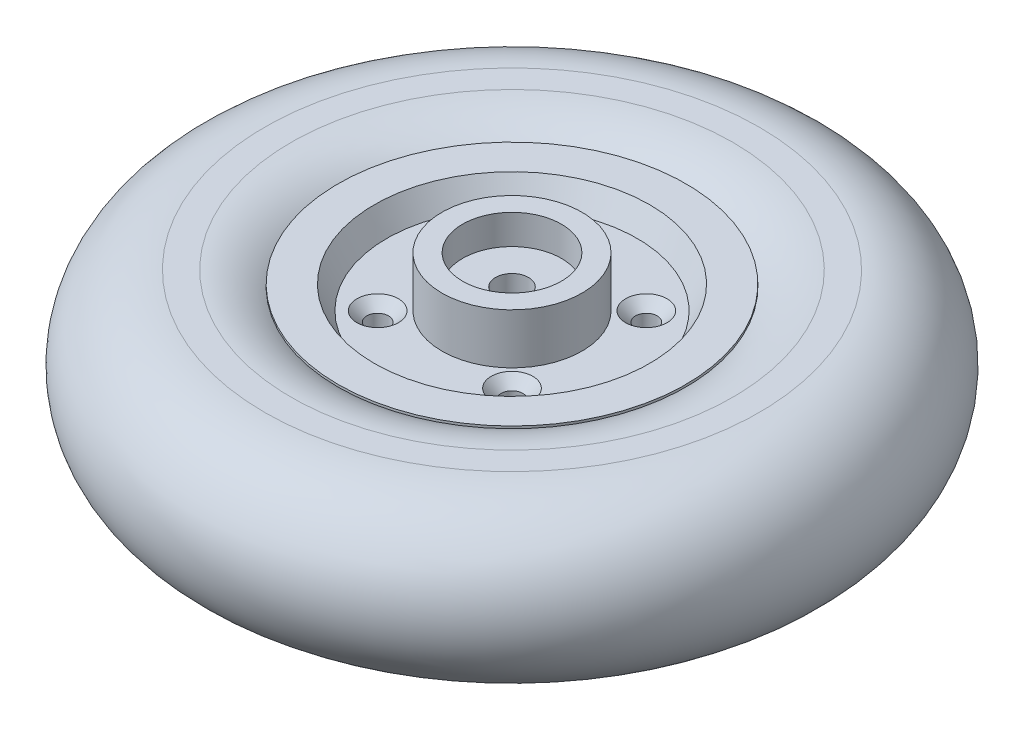
ISO-10303-21;
HEADER;
FILE_DESCRIPTION(('STEP AP214'),'2;1');
FILE_NAME('part.step','',(''),(''),'','','');
FILE_SCHEMA(('AUTOMOTIVE_DESIGN { 1 0 10303 214 1 1 1 1 }'));
ENDSEC;
DATA;
#1=APPLICATION_CONTEXT('core data for automotive mechanical design processes');
#2=APPLICATION_PROTOCOL_DEFINITION('international standard','automotive_design',2000,#1);
#3=PRODUCT_CONTEXT('',#1,'mechanical');
#4=PRODUCT('Part','Part','',(#3));
#5=PRODUCT_RELATED_PRODUCT_CATEGORY('part','',(#4));
#6=PRODUCT_DEFINITION_FORMATION('','',#4);
#7=PRODUCT_DEFINITION_CONTEXT('part definition',#1,'design');
#8=PRODUCT_DEFINITION('design','',#6,#7);
#9=PRODUCT_DEFINITION_SHAPE('','',#8);
#10=(LENGTH_UNIT() NAMED_UNIT(*) SI_UNIT(.MILLI.,.METRE.));
#11=(NAMED_UNIT(*) PLANE_ANGLE_UNIT() SI_UNIT($,.RADIAN.));
#12=(NAMED_UNIT(*) SI_UNIT($,.STERADIAN.) SOLID_ANGLE_UNIT());
#13=UNCERTAINTY_MEASURE_WITH_UNIT(LENGTH_MEASURE(1.E-05),#10,'distance_accuracy_value','');
#14=(GEOMETRIC_REPRESENTATION_CONTEXT(3) GLOBAL_UNCERTAINTY_ASSIGNED_CONTEXT((#13)) GLOBAL_UNIT_ASSIGNED_CONTEXT((#10,
#11,#12)) REPRESENTATION_CONTEXT('',''));
#15=CARTESIAN_POINT('',(0.,0.,0.));
#16=DIRECTION('',(0.,0.,1.));
#17=DIRECTION('',(1.,0.,0.));
#18=AXIS2_PLACEMENT_3D('',#15,#16,#17);
#19=CARTESIAN_POINT('',(0.,152.231132075472,0.));
#20=DIRECTION('',(0.,1.,0.));
#21=DIRECTION('',(0.,0.,1.));
#22=AXIS2_PLACEMENT_3D('',#19,#20,#21);
#23=CYLINDRICAL_SURFACE('',#22,52.75);
#24=CARTESIAN_POINT('',(0.,-21.25,0.));
#25=DIRECTION('',(0.,1.,0.));
#26=DIRECTION('',(0.,0.,1.));
#27=AXIS2_PLACEMENT_3D('',#24,#25,#26);
#28=CIRCLE('',#27,52.75);
#29=CARTESIAN_POINT('',(0.,-21.25,52.75));
#30=VERTEX_POINT('',#29);
#31=EDGE_CURVE('E108',#30,#30,#28,.T.);
#32=ORIENTED_EDGE('',*,*,#31,.T.);
#33=EDGE_LOOP('',(#32));
#34=FACE_BOUND('',#33,.T.);
#35=CARTESIAN_POINT('',(0.,-20.5411173016465,0.));
#36=DIRECTION('',(0.,1.,0.));
#37=DIRECTION('',(0.,0.,1.));
#38=AXIS2_PLACEMENT_3D('',#35,#36,#37);
#39=CIRCLE('',#38,52.75);
#40=CARTESIAN_POINT('',(0.,-20.5411173016465,52.75));
#41=VERTEX_POINT('',#40);
#42=EDGE_CURVE('E10',#41,#41,#39,.T.);
#43=ORIENTED_EDGE('',*,*,#42,.F.);
#44=EDGE_LOOP('',(#43));
#45=FACE_BOUND('',#44,.T.);
#46=ADVANCED_FACE('F30',(#34,#45),#23,.T.);
#47=CARTESIAN_POINT('',(0.,21.25,0.));
#48=DIRECTION('',(0.,1.,0.));
#49=DIRECTION('',(0.,0.,1.));
#50=AXIS2_PLACEMENT_3D('',#47,#48,#49);
#51=CIRCLE('',#50,52.75);
#52=CARTESIAN_POINT('',(0.,21.25,52.75));
#53=VERTEX_POINT('',#52);
#54=EDGE_CURVE('E111',#53,#53,#51,.T.);
#55=ORIENTED_EDGE('',*,*,#54,.F.);
#56=EDGE_LOOP('',(#55));
#57=FACE_BOUND('',#56,.T.);
#58=CARTESIAN_POINT('',(0.,20.5411173016465,0.));
#59=DIRECTION('',(0.,-1.,0.));
#60=DIRECTION('',(0.,0.,-1.));
#61=AXIS2_PLACEMENT_3D('',#58,#59,#60);
#62=CIRCLE('',#61,52.75);
#63=CARTESIAN_POINT('',(0.,20.5411173016465,-52.75));
#64=VERTEX_POINT('',#63);
#65=EDGE_CURVE('E38',#64,#64,#62,.T.);
#66=ORIENTED_EDGE('',*,*,#65,.F.);
#67=EDGE_LOOP('',(#66));
#68=FACE_BOUND('',#67,.T.);
#69=ADVANCED_FACE('F187',(#57,#68),#23,.T.);
#70=CARTESIAN_POINT('',(5.00000000000002,-20.5,0.));
#71=DIRECTION('',(0.,1.,0.));
#72=DIRECTION('',(0.,0.,1.));
#73=AXIS2_PLACEMENT_3D('',#70,#71,#72);
#74=PLANE('',#73);
#75=CARTESIAN_POINT('',(0.,-20.5,0.));
#76=DIRECTION('',(0.,1.,0.));
#77=DIRECTION('',(0.,0.,1.));
#78=AXIS2_PLACEMENT_3D('',#75,#76,#77);
#79=CIRCLE('',#78,15.);
#80=CARTESIAN_POINT('',(0.,-20.5,15.));
#81=VERTEX_POINT('',#80);
#82=EDGE_CURVE('E90',#81,#81,#79,.T.);
#83=ORIENTED_EDGE('',*,*,#82,.F.);
#84=EDGE_LOOP('',(#83));
#85=FACE_BOUND('',#84,.T.);
#86=CARTESIAN_POINT('',(0.,-20.5,0.));
#87=DIRECTION('',(0.,1.,0.));
#88=DIRECTION('',(0.,0.,1.));
#89=AXIS2_PLACEMENT_3D('',#86,#87,#88);
#90=CIRCLE('',#89,5.00000000000002);
#91=CARTESIAN_POINT('',(0.,-20.5,5.00000000000002));
#92=VERTEX_POINT('',#91);
#93=EDGE_CURVE('E43',#92,#92,#90,.T.);
#94=ORIENTED_EDGE('',*,*,#93,.T.);
#95=EDGE_LOOP('',(#94));
#96=FACE_BOUND('',#95,.T.);
#97=ADVANCED_FACE('F32',(#85,#96),#74,.F.);
#98=CARTESIAN_POINT('',(0.,152.231132075472,0.));
#99=DIRECTION('',(0.,1.,0.));
#100=DIRECTION('',(0.,0.,1.));
#101=AXIS2_PLACEMENT_3D('',#98,#99,#100);
#102=CYLINDRICAL_SURFACE('',#101,5.00000000000002);
#103=ORIENTED_EDGE('',*,*,#93,.F.);
#104=EDGE_LOOP('',(#103));
#105=FACE_BOUND('',#104,.T.);
#106=CARTESIAN_POINT('',(0.,20.5,0.));
#107=DIRECTION('',(0.,1.,0.));
#108=DIRECTION('',(0.,0.,1.));
#109=AXIS2_PLACEMENT_3D('',#106,#107,#108);
#110=CIRCLE('',#109,5.00000000000002);
#111=CARTESIAN_POINT('',(0.,20.5,5.00000000000002));
#112=VERTEX_POINT('',#111);
#113=EDGE_CURVE('E132',#112,#112,#110,.T.);
#114=ORIENTED_EDGE('',*,*,#113,.T.);
#115=EDGE_LOOP('',(#114));
#116=FACE_BOUND('',#115,.T.);
#117=ADVANCED_FACE('F138',(#105,#116),#102,.F.);
#118=CARTESIAN_POINT('',(5.00000000000002,20.5,0.));
#119=DIRECTION('',(0.,-1.,0.));
#120=DIRECTION('',(0.,0.,-1.));
#121=AXIS2_PLACEMENT_3D('',#118,#119,#120);
#122=PLANE('',#121);
#123=ORIENTED_EDGE('',*,*,#113,.F.);
#124=EDGE_LOOP('',(#123));
#125=FACE_BOUND('',#124,.T.);
#126=CARTESIAN_POINT('',(0.,20.5,0.));
#127=DIRECTION('',(0.,1.,0.));
#128=DIRECTION('',(0.,0.,1.));
#129=AXIS2_PLACEMENT_3D('',#126,#127,#128);
#130=CIRCLE('',#129,15.);
#131=CARTESIAN_POINT('',(0.,20.5,15.));
#132=VERTEX_POINT('',#131);
#133=EDGE_CURVE('E129',#132,#132,#130,.T.);
#134=ORIENTED_EDGE('',*,*,#133,.T.);
#135=EDGE_LOOP('',(#134));
#136=FACE_BOUND('',#135,.T.);
#137=ADVANCED_FACE('F141',(#125,#136),#122,.F.);
#138=CARTESIAN_POINT('',(0.,152.231132075472,0.));
#139=DIRECTION('',(0.,1.,0.));
#140=DIRECTION('',(0.,0.,1.));
#141=AXIS2_PLACEMENT_3D('',#138,#139,#140);
#142=CYLINDRICAL_SURFACE('',#141,15.);
#143=ORIENTED_EDGE('',*,*,#133,.F.);
#144=EDGE_LOOP('',(#143));
#145=FACE_BOUND('',#144,.T.);
#146=CARTESIAN_POINT('',(0.,29.5,0.));
#147=DIRECTION('',(0.,1.,0.));
#148=DIRECTION('',(0.,0.,1.));
#149=AXIS2_PLACEMENT_3D('',#146,#147,#148);
#150=CIRCLE('',#149,15.);
#151=CARTESIAN_POINT('',(0.,29.5,15.));
#152=VERTEX_POINT('',#151);
#153=EDGE_CURVE('E126',#152,#152,#150,.T.);
#154=ORIENTED_EDGE('',*,*,#153,.T.);
#155=EDGE_LOOP('',(#154));
#156=FACE_BOUND('',#155,.T.);
#157=ADVANCED_FACE('F146',(#145,#156),#142,.F.);
#158=CARTESIAN_POINT('',(15.,29.5,0.));
#159=DIRECTION('',(0.,-1.,0.));
#160=DIRECTION('',(0.,0.,-1.));
#161=AXIS2_PLACEMENT_3D('',#158,#159,#160);
#162=PLANE('',#161);
#163=ORIENTED_EDGE('',*,*,#153,.F.);
#164=EDGE_LOOP('',(#163));
#165=FACE_BOUND('',#164,.T.);
#166=CARTESIAN_POINT('',(0.,29.5,0.));
#167=DIRECTION('',(0.,1.,0.));
#168=DIRECTION('',(0.,0.,1.));
#169=AXIS2_PLACEMENT_3D('',#166,#167,#168);
#170=CIRCLE('',#169,21.25);
#171=CARTESIAN_POINT('',(0.,29.5,21.25));
#172=VERTEX_POINT('',#171);
#173=EDGE_CURVE('E123',#172,#172,#170,.T.);
#174=ORIENTED_EDGE('',*,*,#173,.T.);
#175=EDGE_LOOP('',(#174));
#176=FACE_BOUND('',#175,.T.);
#177=ADVANCED_FACE('F152',(#165,#176),#162,.F.);
#178=CARTESIAN_POINT('',(0.,152.231132075472,0.));
#179=DIRECTION('',(0.,1.,0.));
#180=DIRECTION('',(0.,0.,1.));
#181=AXIS2_PLACEMENT_3D('',#178,#179,#180);
#182=CYLINDRICAL_SURFACE('',#181,21.25);
#183=ORIENTED_EDGE('',*,*,#173,.F.);
#184=EDGE_LOOP('',(#183));
#185=FACE_BOUND('',#184,.T.);
#186=CARTESIAN_POINT('',(0.,14.25,0.));
#187=DIRECTION('',(0.,1.,0.));
#188=DIRECTION('',(0.,0.,1.));
#189=AXIS2_PLACEMENT_3D('',#186,#187,#188);
#190=CIRCLE('',#189,21.25);
#191=CARTESIAN_POINT('',(0.,14.25,21.25));
#192=VERTEX_POINT('',#191);
#193=EDGE_CURVE('E120',#192,#192,#190,.T.);
#194=ORIENTED_EDGE('',*,*,#193,.T.);
#195=EDGE_LOOP('',(#194));
#196=FACE_BOUND('',#195,.T.);
#197=ADVANCED_FACE('F158',(#185,#196),#182,.T.);
#198=CARTESIAN_POINT('',(38.,14.25,0.));
#199=DIRECTION('',(0.,-1.,0.));
#200=DIRECTION('',(0.,0.,-1.));
#201=AXIS2_PLACEMENT_3D('',#198,#199,#200);
#202=PLANE('',#201);
#203=CARTESIAN_POINT('',(-20.375,14.25,20.375));
#204=DIRECTION('',(0.,1.,0.));
#205=DIRECTION('',(0.,0.,1.));
#206=AXIS2_PLACEMENT_3D('',#203,#204,#205);
#207=CIRCLE('',#206,6.3);
#208=CARTESIAN_POINT('',(-20.375,14.25,26.675));
#209=VERTEX_POINT('',#208);
#210=EDGE_CURVE('E292',#209,#209,#207,.T.);
#211=ORIENTED_EDGE('',*,*,#210,.F.);
#212=EDGE_LOOP('',(#211));
#213=FACE_BOUND('',#212,.T.);
#214=CARTESIAN_POINT('',(-20.375,14.25,-20.375));
#215=DIRECTION('',(0.,1.,0.));
#216=DIRECTION('',(0.,0.,1.));
#217=AXIS2_PLACEMENT_3D('',#214,#215,#216);
#218=CIRCLE('',#217,6.3);
#219=CARTESIAN_POINT('',(-20.375,14.25,-14.075));
#220=VERTEX_POINT('',#219);
#221=EDGE_CURVE('E65',#220,#220,#218,.T.);
#222=ORIENTED_EDGE('',*,*,#221,.F.);
#223=EDGE_LOOP('',(#222));
#224=FACE_BOUND('',#223,.T.);
#225=CARTESIAN_POINT('',(20.375,14.25,20.375));
#226=DIRECTION('',(0.,1.,0.));
#227=DIRECTION('',(0.,0.,1.));
#228=AXIS2_PLACEMENT_3D('',#225,#226,#227);
#229=CIRCLE('',#228,6.3);
#230=CARTESIAN_POINT('',(20.375,14.25,26.675));
#231=VERTEX_POINT('',#230);
#232=EDGE_CURVE('E58',#231,#231,#229,.T.);
#233=ORIENTED_EDGE('',*,*,#232,.F.);
#234=EDGE_LOOP('',(#233));
#235=FACE_BOUND('',#234,.T.);
#236=CARTESIAN_POINT('',(20.375,14.25,-20.375));
#237=DIRECTION('',(0.,1.,0.));
#238=DIRECTION('',(0.,0.,1.));
#239=AXIS2_PLACEMENT_3D('',#236,#237,#238);
#240=CIRCLE('',#239,6.3);
#241=CARTESIAN_POINT('',(20.375,14.25,-14.075));
#242=VERTEX_POINT('',#241);
#243=EDGE_CURVE('E54',#242,#242,#240,.T.);
#244=ORIENTED_EDGE('',*,*,#243,.F.);
#245=EDGE_LOOP('',(#244));
#246=FACE_BOUND('',#245,.T.);
#247=ORIENTED_EDGE('',*,*,#193,.F.);
#248=EDGE_LOOP('',(#247));
#249=FACE_BOUND('',#248,.T.);
#250=CARTESIAN_POINT('',(0.,14.25,0.));
#251=DIRECTION('',(0.,1.,0.));
#252=DIRECTION('',(0.,0.,1.));
#253=AXIS2_PLACEMENT_3D('',#250,#251,#252);
#254=CIRCLE('',#253,38.);
#255=CARTESIAN_POINT('',(0.,14.25,38.));
#256=VERTEX_POINT('',#255);
#257=EDGE_CURVE('E117',#256,#256,#254,.T.);
#258=ORIENTED_EDGE('',*,*,#257,.T.);
#259=EDGE_LOOP('',(#258));
#260=FACE_BOUND('',#259,.T.);
#261=ADVANCED_FACE('F164',(#213,#224,#235,#246,#249,#260),#202,.F.);
#262=CARTESIAN_POINT('',(0.,21.25,0.));
#263=DIRECTION('',(0.,1.,0.));
#264=DIRECTION('',(0.,0.,1.));
#265=AXIS2_PLACEMENT_3D('',#262,#263,#264);
#266=CONICAL_SURFACE('',#265,41.75,0.491809175988701);
#267=ORIENTED_EDGE('',*,*,#257,.F.);
#268=EDGE_LOOP('',(#267));
#269=FACE_BOUND('',#268,.T.);
#270=CARTESIAN_POINT('',(0.,21.25,0.));
#271=DIRECTION('',(0.,1.,0.));
#272=DIRECTION('',(0.,0.,1.));
#273=AXIS2_PLACEMENT_3D('',#270,#271,#272);
#274=CIRCLE('',#273,41.75);
#275=CARTESIAN_POINT('',(0.,21.25,41.75));
#276=VERTEX_POINT('',#275);
#277=EDGE_CURVE('E114',#276,#276,#274,.T.);
#278=ORIENTED_EDGE('',*,*,#277,.T.);
#279=EDGE_LOOP('',(#278));
#280=FACE_BOUND('',#279,.T.);
#281=ADVANCED_FACE('F170',(#269,#280),#266,.F.);
#282=CARTESIAN_POINT('',(41.75,21.25,0.));
#283=DIRECTION('',(0.,-1.,0.));
#284=DIRECTION('',(0.,0.,-1.));
#285=AXIS2_PLACEMENT_3D('',#282,#283,#284);
#286=PLANE('',#285);
#287=ORIENTED_EDGE('',*,*,#277,.F.);
#288=EDGE_LOOP('',(#287));
#289=FACE_BOUND('',#288,.T.);
#290=ORIENTED_EDGE('',*,*,#54,.T.);
#291=EDGE_LOOP('',(#290));
#292=FACE_BOUND('',#291,.T.);
#293=ADVANCED_FACE('F177',(#289,#292),#286,.F.);
#294=CARTESIAN_POINT('',(41.75,-21.25,0.));
#295=DIRECTION('',(0.,1.,0.));
#296=DIRECTION('',(0.,0.,1.));
#297=AXIS2_PLACEMENT_3D('',#294,#295,#296);
#298=PLANE('',#297);
#299=ORIENTED_EDGE('',*,*,#31,.F.);
#300=EDGE_LOOP('',(#299));
#301=FACE_BOUND('',#300,.T.);
#302=CARTESIAN_POINT('',(0.,-21.25,0.));
#303=DIRECTION('',(0.,1.,0.));
#304=DIRECTION('',(0.,0.,1.));
#305=AXIS2_PLACEMENT_3D('',#302,#303,#304);
#306=CIRCLE('',#305,41.75);
#307=CARTESIAN_POINT('',(0.,-21.25,41.75));
#308=VERTEX_POINT('',#307);
#309=EDGE_CURVE('E105',#308,#308,#306,.T.);
#310=ORIENTED_EDGE('',*,*,#309,.T.);
#311=EDGE_LOOP('',(#310));
#312=FACE_BOUND('',#311,.T.);
#313=ADVANCED_FACE('F183',(#301,#312),#298,.F.);
#314=CARTESIAN_POINT('',(0.,-14.25,0.));
#315=DIRECTION('',(0.,-1.,0.));
#316=DIRECTION('',(0.,0.,-1.));
#317=AXIS2_PLACEMENT_3D('',#314,#315,#316);
#318=CONICAL_SURFACE('',#317,38.,0.491809175988701);
#319=ORIENTED_EDGE('',*,*,#309,.F.);
#320=EDGE_LOOP('',(#319));
#321=FACE_BOUND('',#320,.T.);
#322=CARTESIAN_POINT('',(0.,-14.25,0.));
#323=DIRECTION('',(0.,1.,0.));
#324=DIRECTION('',(0.,0.,1.));
#325=AXIS2_PLACEMENT_3D('',#322,#323,#324);
#326=CIRCLE('',#325,38.);
#327=CARTESIAN_POINT('',(0.,-14.25,38.));
#328=VERTEX_POINT('',#327);
#329=EDGE_CURVE('E102',#328,#328,#326,.T.);
#330=ORIENTED_EDGE('',*,*,#329,.T.);
#331=EDGE_LOOP('',(#330));
#332=FACE_BOUND('',#331,.T.);
#333=ADVANCED_FACE('F219',(#321,#332),#318,.F.);
#334=CARTESIAN_POINT('',(38.,-14.25,0.));
#335=DIRECTION('',(0.,1.,0.));
#336=DIRECTION('',(0.,0.,1.));
#337=AXIS2_PLACEMENT_3D('',#334,#335,#336);
#338=PLANE('',#337);
#339=CARTESIAN_POINT('',(-20.375,-14.25,20.375));
#340=DIRECTION('',(0.,1.,0.));
#341=DIRECTION('',(0.,0.,1.));
#342=AXIS2_PLACEMENT_3D('',#339,#340,#341);
#343=CIRCLE('',#342,3.3);
#344=CARTESIAN_POINT('',(-20.375,-14.25,23.675));
#345=VERTEX_POINT('',#344);
#346=EDGE_CURVE('E34',#345,#345,#343,.T.);
#347=ORIENTED_EDGE('',*,*,#346,.T.);
#348=EDGE_LOOP('',(#347));
#349=FACE_BOUND('',#348,.T.);
#350=CARTESIAN_POINT('',(-20.375,-14.25,-20.375));
#351=DIRECTION('',(0.,1.,0.));
#352=DIRECTION('',(0.,0.,1.));
#353=AXIS2_PLACEMENT_3D('',#350,#351,#352);
#354=CIRCLE('',#353,3.3);
#355=CARTESIAN_POINT('',(-20.375,-14.25,-17.075));
#356=VERTEX_POINT('',#355);
#357=EDGE_CURVE('E56',#356,#356,#354,.T.);
#358=ORIENTED_EDGE('',*,*,#357,.T.);
#359=EDGE_LOOP('',(#358));
#360=FACE_BOUND('',#359,.T.);
#361=CARTESIAN_POINT('',(20.375,-14.25,20.375));
#362=DIRECTION('',(0.,1.,0.));
#363=DIRECTION('',(0.,0.,1.));
#364=AXIS2_PLACEMENT_3D('',#361,#362,#363);
#365=CIRCLE('',#364,3.3);
#366=CARTESIAN_POINT('',(20.375,-14.25,23.675));
#367=VERTEX_POINT('',#366);
#368=EDGE_CURVE('E52',#367,#367,#365,.T.);
#369=ORIENTED_EDGE('',*,*,#368,.T.);
#370=EDGE_LOOP('',(#369));
#371=FACE_BOUND('',#370,.T.);
#372=CARTESIAN_POINT('',(20.375,-14.25,-20.375));
#373=DIRECTION('',(0.,1.,0.));
#374=DIRECTION('',(0.,0.,1.));
#375=AXIS2_PLACEMENT_3D('',#372,#373,#374);
#376=CIRCLE('',#375,3.3);
#377=CARTESIAN_POINT('',(20.375,-14.25,-17.075));
#378=VERTEX_POINT('',#377);
#379=EDGE_CURVE('E47',#378,#378,#376,.T.);
#380=ORIENTED_EDGE('',*,*,#379,.T.);
#381=EDGE_LOOP('',(#380));
#382=FACE_BOUND('',#381,.T.);
#383=ORIENTED_EDGE('',*,*,#329,.F.);
#384=EDGE_LOOP('',(#383));
#385=FACE_BOUND('',#384,.T.);
#386=CARTESIAN_POINT('',(0.,-14.25,0.));
#387=DIRECTION('',(0.,1.,0.));
#388=DIRECTION('',(0.,0.,1.));
#389=AXIS2_PLACEMENT_3D('',#386,#387,#388);
#390=CIRCLE('',#389,21.25);
#391=CARTESIAN_POINT('',(0.,-14.25,21.25));
#392=VERTEX_POINT('',#391);
#393=EDGE_CURVE('E99',#392,#392,#390,.T.);
#394=ORIENTED_EDGE('',*,*,#393,.T.);
#395=EDGE_LOOP('',(#394));
#396=FACE_BOUND('',#395,.T.);
#397=ADVANCED_FACE('F223',(#349,#360,#371,#382,#385,#396),#338,.F.);
#398=CARTESIAN_POINT('',(0.,152.231132075472,0.));
#399=DIRECTION('',(0.,1.,0.));
#400=DIRECTION('',(0.,0.,1.));
#401=AXIS2_PLACEMENT_3D('',#398,#399,#400);
#402=CYLINDRICAL_SURFACE('',#401,21.25);
#403=ORIENTED_EDGE('',*,*,#393,.F.);
#404=EDGE_LOOP('',(#403));
#405=FACE_BOUND('',#404,.T.);
#406=CARTESIAN_POINT('',(0.,-29.5,0.));
#407=DIRECTION('',(0.,1.,0.));
#408=DIRECTION('',(0.,0.,1.));
#409=AXIS2_PLACEMENT_3D('',#406,#407,#408);
#410=CIRCLE('',#409,21.25);
#411=CARTESIAN_POINT('',(0.,-29.5,21.25));
#412=VERTEX_POINT('',#411);
#413=EDGE_CURVE('E96',#412,#412,#410,.T.);
#414=ORIENTED_EDGE('',*,*,#413,.T.);
#415=EDGE_LOOP('',(#414));
#416=FACE_BOUND('',#415,.T.);
#417=ADVANCED_FACE('F227',(#405,#416),#402,.T.);
#418=CARTESIAN_POINT('',(15.,-29.5,0.));
#419=DIRECTION('',(0.,1.,0.));
#420=DIRECTION('',(0.,0.,1.));
#421=AXIS2_PLACEMENT_3D('',#418,#419,#420);
#422=PLANE('',#421);
#423=ORIENTED_EDGE('',*,*,#413,.F.);
#424=EDGE_LOOP('',(#423));
#425=FACE_BOUND('',#424,.T.);
#426=CARTESIAN_POINT('',(0.,-29.5,0.));
#427=DIRECTION('',(0.,1.,0.));
#428=DIRECTION('',(0.,0.,1.));
#429=AXIS2_PLACEMENT_3D('',#426,#427,#428);
#430=CIRCLE('',#429,15.);
#431=CARTESIAN_POINT('',(0.,-29.5,15.));
#432=VERTEX_POINT('',#431);
#433=EDGE_CURVE('E93',#432,#432,#430,.T.);
#434=ORIENTED_EDGE('',*,*,#433,.T.);
#435=EDGE_LOOP('',(#434));
#436=FACE_BOUND('',#435,.T.);
#437=ADVANCED_FACE('F231',(#425,#436),#422,.F.);
#438=CARTESIAN_POINT('',(0.,152.231132075472,0.));
#439=DIRECTION('',(0.,1.,0.));
#440=DIRECTION('',(0.,0.,1.));
#441=AXIS2_PLACEMENT_3D('',#438,#439,#440);
#442=CYLINDRICAL_SURFACE('',#441,15.);
#443=ORIENTED_EDGE('',*,*,#433,.F.);
#444=EDGE_LOOP('',(#443));
#445=FACE_BOUND('',#444,.T.);
#446=ORIENTED_EDGE('',*,*,#82,.T.);
#447=EDGE_LOOP('',(#446));
#448=FACE_BOUND('',#447,.T.);
#449=ADVANCED_FACE('F206',(#445,#448),#442,.F.);
#450=CARTESIAN_POINT('',(0.,0.,0.));
#451=DIRECTION('',(0.,-1.,0.));
#452=DIRECTION('',(0.,0.,-1.));
#453=AXIS2_PLACEMENT_3D('',#450,#451,#452);
#454=TOROIDAL_SURFACE('',#453,67.,25.);
#455=CARTESIAN_POINT('',(0.,-25.,0.));
#456=DIRECTION('',(0.,-1.,0.));
#457=DIRECTION('',(0.,0.,-1.));
#458=AXIS2_PLACEMENT_3D('',#455,#456,#457);
#459=CIRCLE('',#458,67.);
#460=CARTESIAN_POINT('',(0.,-25.,-67.));
#461=VERTEX_POINT('',#460);
#462=EDGE_CURVE('E84',#461,#461,#459,.T.);
#463=ORIENTED_EDGE('',*,*,#462,.T.);
#464=EDGE_LOOP('',(#463));
#465=FACE_BOUND('',#464,.T.);
#466=ORIENTED_EDGE('',*,*,#42,.T.);
#467=EDGE_LOOP('',(#466));
#468=FACE_BOUND('',#467,.T.);
#469=ADVANCED_FACE('F196',(#465,#468),#454,.T.);
#470=CARTESIAN_POINT('',(0.,25.,0.));
#471=DIRECTION('',(0.,-1.,0.));
#472=DIRECTION('',(0.,0.,-1.));
#473=AXIS2_PLACEMENT_3D('',#470,#471,#472);
#474=CIRCLE('',#473,67.);
#475=CARTESIAN_POINT('',(0.,25.,-67.));
#476=VERTEX_POINT('',#475);
#477=EDGE_CURVE('E81',#476,#476,#474,.T.);
#478=ORIENTED_EDGE('',*,*,#477,.F.);
#479=EDGE_LOOP('',(#478));
#480=FACE_BOUND('',#479,.T.);
#481=ORIENTED_EDGE('',*,*,#65,.T.);
#482=EDGE_LOOP('',(#481));
#483=FACE_BOUND('',#482,.T.);
#484=ADVANCED_FACE('F193',(#480,#483),#454,.T.);
#485=CARTESIAN_POINT('',(0.,0.,0.));
#486=DIRECTION('',(0.,-1.,0.));
#487=DIRECTION('',(0.,0.,-1.));
#488=AXIS2_PLACEMENT_3D('',#485,#486,#487);
#489=TOROIDAL_SURFACE('',#488,75.,25.);
#490=CARTESIAN_POINT('',(0.,-25.,0.));
#491=DIRECTION('',(0.,-1.,0.));
#492=DIRECTION('',(0.,0.,-1.));
#493=AXIS2_PLACEMENT_3D('',#490,#491,#492);
#494=CIRCLE('',#493,75.);
#495=CARTESIAN_POINT('',(0.,-25.,-75.));
#496=VERTEX_POINT('',#495);
#497=EDGE_CURVE('E87',#496,#496,#494,.T.);
#498=ORIENTED_EDGE('',*,*,#497,.F.);
#499=EDGE_LOOP('',(#498));
#500=FACE_BOUND('',#499,.T.);
#501=CARTESIAN_POINT('',(0.,25.,0.));
#502=DIRECTION('',(0.,-1.,0.));
#503=DIRECTION('',(0.,0.,-1.));
#504=AXIS2_PLACEMENT_3D('',#501,#502,#503);
#505=CIRCLE('',#504,75.);
#506=CARTESIAN_POINT('',(0.,25.,-75.));
#507=VERTEX_POINT('',#506);
#508=EDGE_CURVE('E50',#507,#507,#505,.T.);
#509=ORIENTED_EDGE('',*,*,#508,.T.);
#510=EDGE_LOOP('',(#509));
#511=FACE_BOUND('',#510,.T.);
#512=ADVANCED_FACE('F195',(#500,#511),#489,.T.);
#513=CARTESIAN_POINT('',(-75.,-25.,0.));
#514=DIRECTION('',(0.,1.,0.));
#515=DIRECTION('',(0.,0.,1.));
#516=AXIS2_PLACEMENT_3D('',#513,#514,#515);
#517=PLANE('',#516);
#518=ORIENTED_EDGE('',*,*,#462,.F.);
#519=EDGE_LOOP('',(#518));
#520=FACE_BOUND('',#519,.T.);
#521=ORIENTED_EDGE('',*,*,#497,.T.);
#522=EDGE_LOOP('',(#521));
#523=FACE_BOUND('',#522,.T.);
#524=ADVANCED_FACE('F203',(#520,#523),#517,.F.);
#525=CARTESIAN_POINT('',(-75.,25.,0.));
#526=DIRECTION('',(0.,-1.,0.));
#527=DIRECTION('',(0.,0.,-1.));
#528=AXIS2_PLACEMENT_3D('',#525,#526,#527);
#529=PLANE('',#528);
#530=ORIENTED_EDGE('',*,*,#508,.F.);
#531=EDGE_LOOP('',(#530));
#532=FACE_BOUND('',#531,.T.);
#533=ORIENTED_EDGE('',*,*,#477,.T.);
#534=EDGE_LOOP('',(#533));
#535=FACE_BOUND('',#534,.T.);
#536=ADVANCED_FACE('F239',(#532,#535),#529,.F.);
#537=CARTESIAN_POINT('',(20.375,14.25,-20.375));
#538=DIRECTION('',(0.,1.,0.));
#539=DIRECTION('',(0.,0.,1.));
#540=AXIS2_PLACEMENT_3D('',#537,#538,#539);
#541=CYLINDRICAL_SURFACE('',#540,3.3);
#542=CARTESIAN_POINT('',(20.375,11.25,-20.375));
#543=DIRECTION('',(0.,1.,0.));
#544=DIRECTION('',(0.,0.,1.));
#545=AXIS2_PLACEMENT_3D('',#542,#543,#544);
#546=CIRCLE('',#545,3.3);
#547=CARTESIAN_POINT('',(20.375,11.25,-17.075));
#548=VERTEX_POINT('',#547);
#549=EDGE_CURVE('E51',#548,#548,#546,.T.);
#550=ORIENTED_EDGE('',*,*,#549,.T.);
#551=EDGE_LOOP('',(#550));
#552=FACE_BOUND('',#551,.T.);
#553=ORIENTED_EDGE('',*,*,#379,.F.);
#554=EDGE_LOOP('',(#553));
#555=FACE_BOUND('',#554,.T.);
#556=ADVANCED_FACE('F244',(#552,#555),#541,.F.);
#557=CARTESIAN_POINT('',(20.375,14.25,-20.375));
#558=DIRECTION('',(0.,1.,0.));
#559=DIRECTION('',(0.,0.,1.));
#560=AXIS2_PLACEMENT_3D('',#557,#558,#559);
#561=CONICAL_SURFACE('',#560,6.3,0.785398163397449);
#562=ORIENTED_EDGE('',*,*,#549,.F.);
#563=EDGE_LOOP('',(#562));
#564=FACE_BOUND('',#563,.T.);
#565=ORIENTED_EDGE('',*,*,#243,.T.);
#566=EDGE_LOOP('',(#565));
#567=FACE_BOUND('',#566,.T.);
#568=ADVANCED_FACE('F255',(#564,#567),#561,.F.);
#569=CARTESIAN_POINT('',(20.375,14.25,20.375));
#570=DIRECTION('',(0.,1.,0.));
#571=DIRECTION('',(0.,0.,1.));
#572=AXIS2_PLACEMENT_3D('',#569,#570,#571);
#573=CYLINDRICAL_SURFACE('',#572,3.3);
#574=CARTESIAN_POINT('',(20.375,11.25,20.375));
#575=DIRECTION('',(0.,1.,0.));
#576=DIRECTION('',(0.,0.,1.));
#577=AXIS2_PLACEMENT_3D('',#574,#575,#576);
#578=CIRCLE('',#577,3.3);
#579=CARTESIAN_POINT('',(20.375,11.25,23.675));
#580=VERTEX_POINT('',#579);
#581=EDGE_CURVE('E55',#580,#580,#578,.T.);
#582=ORIENTED_EDGE('',*,*,#581,.T.);
#583=EDGE_LOOP('',(#582));
#584=FACE_BOUND('',#583,.T.);
#585=ORIENTED_EDGE('',*,*,#368,.F.);
#586=EDGE_LOOP('',(#585));
#587=FACE_BOUND('',#586,.T.);
#588=ADVANCED_FACE('F261',(#584,#587),#573,.F.);
#589=CARTESIAN_POINT('',(20.375,14.25,20.375));
#590=DIRECTION('',(0.,1.,0.));
#591=DIRECTION('',(0.,0.,1.));
#592=AXIS2_PLACEMENT_3D('',#589,#590,#591);
#593=CONICAL_SURFACE('',#592,6.3,0.785398163397449);
#594=ORIENTED_EDGE('',*,*,#581,.F.);
#595=EDGE_LOOP('',(#594));
#596=FACE_BOUND('',#595,.T.);
#597=ORIENTED_EDGE('',*,*,#232,.T.);
#598=EDGE_LOOP('',(#597));
#599=FACE_BOUND('',#598,.T.);
#600=ADVANCED_FACE('F265',(#596,#599),#593,.F.);
#601=CARTESIAN_POINT('',(-20.375,14.25,-20.375));
#602=DIRECTION('',(0.,1.,0.));
#603=DIRECTION('',(0.,0.,1.));
#604=AXIS2_PLACEMENT_3D('',#601,#602,#603);
#605=CYLINDRICAL_SURFACE('',#604,3.3);
#606=CARTESIAN_POINT('',(-20.375,11.25,-20.375));
#607=DIRECTION('',(0.,1.,0.));
#608=DIRECTION('',(0.,0.,1.));
#609=AXIS2_PLACEMENT_3D('',#606,#607,#608);
#610=CIRCLE('',#609,3.3);
#611=CARTESIAN_POINT('',(-20.375,11.25,-17.075));
#612=VERTEX_POINT('',#611);
#613=EDGE_CURVE('E59',#612,#612,#610,.T.);
#614=ORIENTED_EDGE('',*,*,#613,.T.);
#615=EDGE_LOOP('',(#614));
#616=FACE_BOUND('',#615,.T.);
#617=ORIENTED_EDGE('',*,*,#357,.F.);
#618=EDGE_LOOP('',(#617));
#619=FACE_BOUND('',#618,.T.);
#620=ADVANCED_FACE('F269',(#616,#619),#605,.F.);
#621=CARTESIAN_POINT('',(-20.375,14.25,-20.375));
#622=DIRECTION('',(0.,1.,0.));
#623=DIRECTION('',(0.,0.,1.));
#624=AXIS2_PLACEMENT_3D('',#621,#622,#623);
#625=CONICAL_SURFACE('',#624,6.3,0.785398163397449);
#626=ORIENTED_EDGE('',*,*,#613,.F.);
#627=EDGE_LOOP('',(#626));
#628=FACE_BOUND('',#627,.T.);
#629=ORIENTED_EDGE('',*,*,#221,.T.);
#630=EDGE_LOOP('',(#629));
#631=FACE_BOUND('',#630,.T.);
#632=ADVANCED_FACE('F273',(#628,#631),#625,.F.);
#633=CARTESIAN_POINT('',(-20.375,14.25,20.375));
#634=DIRECTION('',(0.,1.,0.));
#635=DIRECTION('',(0.,0.,1.));
#636=AXIS2_PLACEMENT_3D('',#633,#634,#635);
#637=CYLINDRICAL_SURFACE('',#636,3.3);
#638=CARTESIAN_POINT('',(-20.375,11.25,20.375));
#639=DIRECTION('',(0.,1.,0.));
#640=DIRECTION('',(0.,0.,1.));
#641=AXIS2_PLACEMENT_3D('',#638,#639,#640);
#642=CIRCLE('',#641,3.3);
#643=CARTESIAN_POINT('',(-20.375,11.25,23.675));
#644=VERTEX_POINT('',#643);
#645=EDGE_CURVE('E289',#644,#644,#642,.T.);
#646=ORIENTED_EDGE('',*,*,#645,.T.);
#647=EDGE_LOOP('',(#646));
#648=FACE_BOUND('',#647,.T.);
#649=ORIENTED_EDGE('',*,*,#346,.F.);
#650=EDGE_LOOP('',(#649));
#651=FACE_BOUND('',#650,.T.);
#652=ADVANCED_FACE('F276',(#648,#651),#637,.F.);
#653=CARTESIAN_POINT('',(-20.375,14.25,20.375));
#654=DIRECTION('',(0.,1.,0.));
#655=DIRECTION('',(0.,0.,1.));
#656=AXIS2_PLACEMENT_3D('',#653,#654,#655);
#657=CONICAL_SURFACE('',#656,6.3,0.785398163397449);
#658=ORIENTED_EDGE('',*,*,#645,.F.);
#659=EDGE_LOOP('',(#658));
#660=FACE_BOUND('',#659,.T.);
#661=ORIENTED_EDGE('',*,*,#210,.T.);
#662=EDGE_LOOP('',(#661));
#663=FACE_BOUND('',#662,.T.);
#664=ADVANCED_FACE('F280',(#660,#663),#657,.F.);
#665=CLOSED_SHELL('',(#46,#69,#97,#117,#137,#157,#177,#197,#261,#281,#293,#313,#333,#397,#417,
#437,#449,#469,#484,#512,#524,#536,#556,#568,#588,#600,#620,#632,#652,#664));
#666=MANIFOLD_SOLID_BREP('B2',#665);
#667=ADVANCED_BREP_SHAPE_REPRESENTATION('',(#18,#666),#14);
#668=SHAPE_DEFINITION_REPRESENTATION(#9,#667);
ENDSEC;
END-ISO-10303-21;
